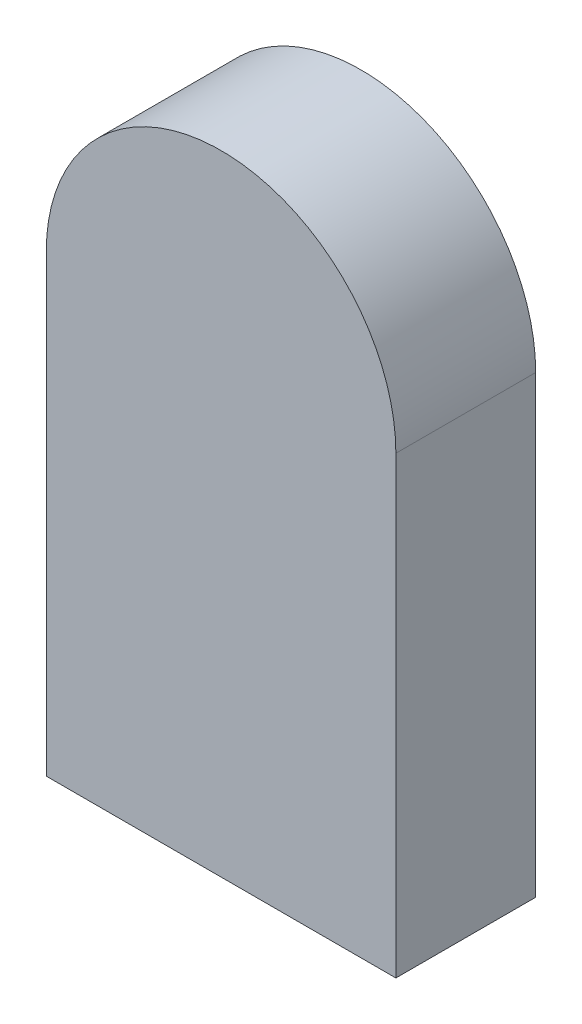
ISO-10303-21;
HEADER;
FILE_DESCRIPTION(('STEP AP214'),'2;1');
FILE_NAME('part.step','',(''),(''),'','','');
FILE_SCHEMA(('AUTOMOTIVE_DESIGN { 1 0 10303 214 1 1 1 1 }'));
ENDSEC;
DATA;
#1=APPLICATION_CONTEXT('core data for automotive mechanical design processes');
#2=APPLICATION_PROTOCOL_DEFINITION('international standard','automotive_design',2000,#1);
#3=PRODUCT_CONTEXT('',#1,'mechanical');
#4=PRODUCT('Part','Part','',(#3));
#5=PRODUCT_RELATED_PRODUCT_CATEGORY('part','',(#4));
#6=PRODUCT_DEFINITION_FORMATION('','',#4);
#7=PRODUCT_DEFINITION_CONTEXT('part definition',#1,'design');
#8=PRODUCT_DEFINITION('design','',#6,#7);
#9=PRODUCT_DEFINITION_SHAPE('','',#8);
#10=(LENGTH_UNIT() NAMED_UNIT(*) SI_UNIT(.MILLI.,.METRE.));
#11=(NAMED_UNIT(*) PLANE_ANGLE_UNIT() SI_UNIT($,.RADIAN.));
#12=(NAMED_UNIT(*) SI_UNIT($,.STERADIAN.) SOLID_ANGLE_UNIT());
#13=UNCERTAINTY_MEASURE_WITH_UNIT(LENGTH_MEASURE(1.E-05),#10,'distance_accuracy_value','');
#14=(GEOMETRIC_REPRESENTATION_CONTEXT(3) GLOBAL_UNCERTAINTY_ASSIGNED_CONTEXT((#13)) GLOBAL_UNIT_ASSIGNED_CONTEXT((#10,
#11,#12)) REPRESENTATION_CONTEXT('',''));
#15=CARTESIAN_POINT('',(0.,0.,0.));
#16=DIRECTION('',(0.,0.,1.));
#17=DIRECTION('',(1.,0.,0.));
#18=AXIS2_PLACEMENT_3D('',#15,#16,#17);
#19=CARTESIAN_POINT('',(0.625,-2.05,0.));
#20=DIRECTION('',(0.,1.,0.));
#21=DIRECTION('',(1.,0.,0.));
#22=AXIS2_PLACEMENT_3D('',#19,#20,#21);
#23=PLANE('',#22);
#24=DIRECTION('',(1.,0.,0.));
#25=VECTOR('',#24,1.);
#26=CARTESIAN_POINT('',(0.625,-2.05,0.));
#27=LINE('',#26,#25);
#28=CARTESIAN_POINT('',(0.625,-2.05,0.));
#29=VERTEX_POINT('',#28);
#30=CARTESIAN_POINT('',(0.875,-2.05,0.));
#31=VERTEX_POINT('',#30);
#32=EDGE_CURVE('E11',#29,#31,#27,.T.);
#33=ORIENTED_EDGE('',*,*,#32,.T.);
#34=DIRECTION('',(0.,0.,1.));
#35=VECTOR('',#34,1.);
#36=CARTESIAN_POINT('',(0.875,-2.05,0.));
#37=LINE('',#36,#35);
#38=CARTESIAN_POINT('',(0.875,-2.05,0.1));
#39=VERTEX_POINT('',#38);
#40=EDGE_CURVE('E24',#31,#39,#37,.T.);
#41=ORIENTED_EDGE('',*,*,#40,.T.);
#42=DIRECTION('',(1.,0.,0.));
#43=VECTOR('',#42,1.);
#44=CARTESIAN_POINT('',(0.625,-2.05,0.1));
#45=LINE('',#44,#43);
#46=CARTESIAN_POINT('',(0.625,-2.05,0.1));
#47=VERTEX_POINT('',#46);
#48=EDGE_CURVE('E87',#47,#39,#45,.T.);
#49=ORIENTED_EDGE('',*,*,#48,.F.);
#50=DIRECTION('',(0.,0.,1.));
#51=VECTOR('',#50,1.);
#52=CARTESIAN_POINT('',(0.625,-2.05,0.));
#53=LINE('',#52,#51);
#54=EDGE_CURVE('E36',#29,#47,#53,.T.);
#55=ORIENTED_EDGE('',*,*,#54,.F.);
#56=EDGE_LOOP('',(#33,#41,#49,#55));
#57=FACE_BOUND('',#56,.T.);
#58=ADVANCED_FACE('F17',(#57),#23,.F.);
#59=CARTESIAN_POINT('',(0.875,-2.05,0.));
#60=DIRECTION('',(-1.,0.,0.));
#61=DIRECTION('',(0.,1.,0.));
#62=AXIS2_PLACEMENT_3D('',#59,#60,#61);
#63=PLANE('',#62);
#64=DIRECTION('',(0.,1.,0.));
#65=VECTOR('',#64,1.);
#66=CARTESIAN_POINT('',(0.875,-2.05,0.));
#67=LINE('',#66,#65);
#68=CARTESIAN_POINT('',(0.875,-1.725,0.));
#69=VERTEX_POINT('',#68);
#70=EDGE_CURVE('E84',#31,#69,#67,.T.);
#71=ORIENTED_EDGE('',*,*,#70,.T.);
#72=DIRECTION('',(0.,0.,1.));
#73=VECTOR('',#72,1.);
#74=CARTESIAN_POINT('',(0.875,-1.725,0.));
#75=LINE('',#74,#73);
#76=CARTESIAN_POINT('',(0.875,-1.725,0.1));
#77=VERTEX_POINT('',#76);
#78=EDGE_CURVE('E82',#69,#77,#75,.T.);
#79=ORIENTED_EDGE('',*,*,#78,.T.);
#80=DIRECTION('',(0.,1.,0.));
#81=VECTOR('',#80,1.);
#82=CARTESIAN_POINT('',(0.875,-2.05,0.1));
#83=LINE('',#82,#81);
#84=EDGE_CURVE('E72',#39,#77,#83,.T.);
#85=ORIENTED_EDGE('',*,*,#84,.F.);
#86=ORIENTED_EDGE('',*,*,#40,.F.);
#87=EDGE_LOOP('',(#71,#79,#85,#86));
#88=FACE_BOUND('',#87,.T.);
#89=ADVANCED_FACE('F89',(#88),#63,.F.);
#90=CARTESIAN_POINT('',(0.75,-1.725,0.));
#91=DIRECTION('',(0.,0.,-1.));
#92=DIRECTION('',(1.,0.,0.));
#93=AXIS2_PLACEMENT_3D('',#90,#91,#92);
#94=CYLINDRICAL_SURFACE('',#93,0.125);
#95=CARTESIAN_POINT('',(0.75,-1.725,0.));
#96=DIRECTION('',(0.,0.,1.));
#97=DIRECTION('',(1.,0.,0.));
#98=AXIS2_PLACEMENT_3D('',#95,#96,#97);
#99=CIRCLE('',#98,0.125);
#100=CARTESIAN_POINT('',(0.625,-1.725,0.));
#101=VERTEX_POINT('',#100);
#102=EDGE_CURVE('E62',#69,#101,#99,.T.);
#103=ORIENTED_EDGE('',*,*,#102,.T.);
#104=DIRECTION('',(0.,0.,1.));
#105=VECTOR('',#104,1.);
#106=CARTESIAN_POINT('',(0.625,-1.725,0.));
#107=LINE('',#106,#105);
#108=CARTESIAN_POINT('',(0.625,-1.725,0.1));
#109=VERTEX_POINT('',#108);
#110=EDGE_CURVE('E57',#101,#109,#107,.T.);
#111=ORIENTED_EDGE('',*,*,#110,.T.);
#112=CARTESIAN_POINT('',(0.75,-1.725,0.1));
#113=DIRECTION('',(0.,0.,1.));
#114=DIRECTION('',(1.,0.,0.));
#115=AXIS2_PLACEMENT_3D('',#112,#113,#114);
#116=CIRCLE('',#115,0.125);
#117=EDGE_CURVE('E60',#77,#109,#116,.T.);
#118=ORIENTED_EDGE('',*,*,#117,.F.);
#119=ORIENTED_EDGE('',*,*,#78,.F.);
#120=EDGE_LOOP('',(#103,#111,#118,#119));
#121=FACE_BOUND('',#120,.T.);
#122=ADVANCED_FACE('F59',(#121),#94,.T.);
#123=CARTESIAN_POINT('',(0.625,-2.05,0.));
#124=DIRECTION('',(-1.,0.,0.));
#125=DIRECTION('',(0.,1.,0.));
#126=AXIS2_PLACEMENT_3D('',#123,#124,#125);
#127=PLANE('',#126);
#128=ORIENTED_EDGE('',*,*,#54,.T.);
#129=DIRECTION('',(0.,1.,0.));
#130=VECTOR('',#129,1.);
#131=CARTESIAN_POINT('',(0.625,-2.05,0.1));
#132=LINE('',#131,#130);
#133=EDGE_CURVE('E71',#47,#109,#132,.T.);
#134=ORIENTED_EDGE('',*,*,#133,.T.);
#135=ORIENTED_EDGE('',*,*,#110,.F.);
#136=DIRECTION('',(0.,1.,0.));
#137=VECTOR('',#136,1.);
#138=CARTESIAN_POINT('',(0.625,-2.05,0.));
#139=LINE('',#138,#137);
#140=EDGE_CURVE('E76',#29,#101,#139,.T.);
#141=ORIENTED_EDGE('',*,*,#140,.F.);
#142=EDGE_LOOP('',(#128,#134,#135,#141));
#143=FACE_BOUND('',#142,.T.);
#144=ADVANCED_FACE('F75',(#143),#127,.T.);
#145=CARTESIAN_POINT('',(0.75,-1.850342514613,0.));
#146=DIRECTION('',(0.,0.,1.));
#147=DIRECTION('',(1.,0.,0.));
#148=AXIS2_PLACEMENT_3D('',#145,#146,#147);
#149=PLANE('',#148);
#150=ORIENTED_EDGE('',*,*,#140,.T.);
#151=ORIENTED_EDGE('',*,*,#102,.F.);
#152=ORIENTED_EDGE('',*,*,#70,.F.);
#153=ORIENTED_EDGE('',*,*,#32,.F.);
#154=EDGE_LOOP('',(#150,#151,#152,#153));
#155=FACE_BOUND('',#154,.T.);
#156=ADVANCED_FACE('F91',(#155),#149,.F.);
#157=CARTESIAN_POINT('',(0.75,-1.850342514613,0.1));
#158=DIRECTION('',(0.,0.,1.));
#159=DIRECTION('',(1.,0.,0.));
#160=AXIS2_PLACEMENT_3D('',#157,#158,#159);
#161=PLANE('',#160);
#162=ORIENTED_EDGE('',*,*,#48,.T.);
#163=ORIENTED_EDGE('',*,*,#84,.T.);
#164=ORIENTED_EDGE('',*,*,#117,.T.);
#165=ORIENTED_EDGE('',*,*,#133,.F.);
#166=EDGE_LOOP('',(#162,#163,#164,#165));
#167=FACE_BOUND('',#166,.T.);
#168=ADVANCED_FACE('F70',(#167),#161,.T.);
#169=CLOSED_SHELL('',(#58,#89,#122,#144,#156,#168));
#170=MANIFOLD_SOLID_BREP('B1',#169);
#171=ADVANCED_BREP_SHAPE_REPRESENTATION('',(#18,#170),#14);
#172=SHAPE_DEFINITION_REPRESENTATION(#9,#171);
ENDSEC;
END-ISO-10303-21;
